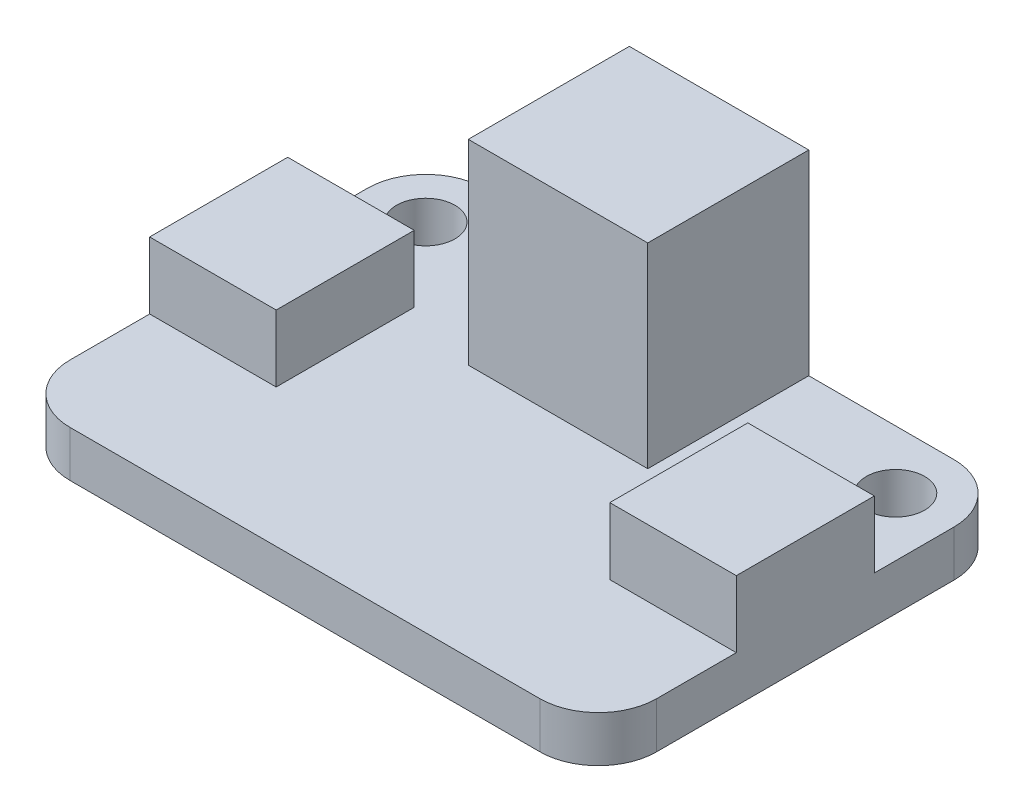
ISO-10303-21;
HEADER;
FILE_DESCRIPTION(('STEP AP214'),'2;1');
FILE_NAME('part.step','',(''),(''),'','','');
FILE_SCHEMA(('AUTOMOTIVE_DESIGN { 1 0 10303 214 1 1 1 1 }'));
ENDSEC;
DATA;
#1=APPLICATION_CONTEXT('core data for automotive mechanical design processes');
#2=APPLICATION_PROTOCOL_DEFINITION('international standard','automotive_design',2000,#1);
#3=PRODUCT_CONTEXT('',#1,'mechanical');
#4=PRODUCT('Part','Part','',(#3));
#5=PRODUCT_RELATED_PRODUCT_CATEGORY('part','',(#4));
#6=PRODUCT_DEFINITION_FORMATION('','',#4);
#7=PRODUCT_DEFINITION_CONTEXT('part definition',#1,'design');
#8=PRODUCT_DEFINITION('design','',#6,#7);
#9=PRODUCT_DEFINITION_SHAPE('','',#8);
#10=(LENGTH_UNIT() NAMED_UNIT(*) SI_UNIT(.MILLI.,.METRE.));
#11=(NAMED_UNIT(*) PLANE_ANGLE_UNIT() SI_UNIT($,.RADIAN.));
#12=(NAMED_UNIT(*) SI_UNIT($,.STERADIAN.) SOLID_ANGLE_UNIT());
#13=UNCERTAINTY_MEASURE_WITH_UNIT(LENGTH_MEASURE(1.E-05),#10,'distance_accuracy_value','');
#14=(GEOMETRIC_REPRESENTATION_CONTEXT(3) GLOBAL_UNCERTAINTY_ASSIGNED_CONTEXT((#13)) GLOBAL_UNIT_ASSIGNED_CONTEXT((#10,
#11,#12)) REPRESENTATION_CONTEXT('',''));
#15=CARTESIAN_POINT('',(0.,0.,0.));
#16=DIRECTION('',(0.,0.,1.));
#17=DIRECTION('',(1.,0.,0.));
#18=AXIS2_PLACEMENT_3D('',#15,#16,#17);
#19=CARTESIAN_POINT('',(0.,2.,0.));
#20=DIRECTION('',(0.,-1.,0.));
#21=DIRECTION('',(0.,0.,-1.));
#22=AXIS2_PLACEMENT_3D('',#19,#20,#21);
#23=PLANE('',#22);
#24=CARTESIAN_POINT('',(22.96,2.,-15.46));
#25=DIRECTION('',(0.,1.,0.));
#26=DIRECTION('',(0.,0.,-1.));
#27=AXIS2_PLACEMENT_3D('',#24,#25,#26);
#28=CIRCLE('',#27,1.27);
#29=CARTESIAN_POINT('',(22.96,2.,-16.73));
#30=VERTEX_POINT('',#29);
#31=EDGE_CURVE('E296',#30,#30,#28,.T.);
#32=ORIENTED_EDGE('',*,*,#31,.F.);
#33=EDGE_LOOP('',(#32));
#34=FACE_BOUND('',#33,.T.);
#35=CARTESIAN_POINT('',(2.54,2.,-15.46));
#36=DIRECTION('',(0.,1.,0.));
#37=DIRECTION('',(0.,0.,1.));
#38=AXIS2_PLACEMENT_3D('',#35,#36,#37);
#39=CIRCLE('',#38,1.27);
#40=CARTESIAN_POINT('',(2.54,2.,-14.19));
#41=VERTEX_POINT('',#40);
#42=EDGE_CURVE('E302',#41,#41,#39,.T.);
#43=ORIENTED_EDGE('',*,*,#42,.F.);
#44=EDGE_LOOP('',(#43));
#45=FACE_BOUND('',#44,.T.);
#46=DIRECTION('',(1.,0.,0.));
#47=VECTOR('',#46,1.);
#48=CARTESIAN_POINT('',(0.,2.,0.));
#49=LINE('',#48,#47);
#50=CARTESIAN_POINT('',(2.54,2.,0.));
#51=VERTEX_POINT('',#50);
#52=CARTESIAN_POINT('',(22.96,2.,0.));
#53=VERTEX_POINT('',#52);
#54=EDGE_CURVE('E316',#51,#53,#49,.T.);
#55=ORIENTED_EDGE('',*,*,#54,.T.);
#56=CARTESIAN_POINT('',(22.96,2.,-2.54));
#57=DIRECTION('',(0.,-1.,0.));
#58=DIRECTION('',(0.,0.,-1.));
#59=AXIS2_PLACEMENT_3D('',#56,#57,#58);
#60=CIRCLE('',#59,2.54);
#61=CARTESIAN_POINT('',(25.5,2.,-2.54));
#62=VERTEX_POINT('',#61);
#63=EDGE_CURVE('E377',#53,#62,#60,.F.);
#64=ORIENTED_EDGE('',*,*,#63,.T.);
#65=DIRECTION('',(0.,0.,-1.));
#66=VECTOR('',#65,1.);
#67=CARTESIAN_POINT('',(25.5,2.,0.));
#68=LINE('',#67,#66);
#69=CARTESIAN_POINT('',(25.5,2.,-6.));
#70=VERTEX_POINT('',#69);
#71=EDGE_CURVE('E322',#62,#70,#68,.T.);
#72=ORIENTED_EDGE('',*,*,#71,.T.);
#73=DIRECTION('',(1.,0.,0.));
#74=VECTOR('',#73,1.);
#75=CARTESIAN_POINT('',(25.5,2.,-6.));
#76=LINE('',#75,#74);
#77=CARTESIAN_POINT('',(20.,2.,-6.));
#78=VERTEX_POINT('',#77);
#79=EDGE_CURVE('E224',#78,#70,#76,.T.);
#80=ORIENTED_EDGE('',*,*,#79,.F.);
#81=DIRECTION('',(0.,0.,1.));
#82=VECTOR('',#81,1.);
#83=CARTESIAN_POINT('',(20.,2.,-12.));
#84=LINE('',#83,#82);
#85=CARTESIAN_POINT('',(20.,2.,-12.));
#86=VERTEX_POINT('',#85);
#87=EDGE_CURVE('E213',#86,#78,#84,.T.);
#88=ORIENTED_EDGE('',*,*,#87,.F.);
#89=DIRECTION('',(-1.,0.,0.));
#90=VECTOR('',#89,1.);
#91=CARTESIAN_POINT('',(25.5,2.,-12.));
#92=LINE('',#91,#90);
#93=CARTESIAN_POINT('',(25.5,2.,-12.));
#94=VERTEX_POINT('',#93);
#95=EDGE_CURVE('E208',#94,#86,#92,.T.);
#96=ORIENTED_EDGE('',*,*,#95,.F.);
#97=CARTESIAN_POINT('',(25.5,2.,-15.46));
#98=VERTEX_POINT('',#97);
#99=EDGE_CURVE('E321',#94,#98,#68,.T.);
#100=ORIENTED_EDGE('',*,*,#99,.T.);
#101=CARTESIAN_POINT('',(22.96,2.,-15.46));
#102=DIRECTION('',(0.,-1.,0.));
#103=DIRECTION('',(0.,0.,-1.));
#104=AXIS2_PLACEMENT_3D('',#101,#102,#103);
#105=CIRCLE('',#104,2.54);
#106=CARTESIAN_POINT('',(22.96,2.,-18.));
#107=VERTEX_POINT('',#106);
#108=EDGE_CURVE('E55',#98,#107,#105,.F.);
#109=ORIENTED_EDGE('',*,*,#108,.T.);
#110=DIRECTION('',(-1.,0.,0.));
#111=VECTOR('',#110,1.);
#112=CARTESIAN_POINT('',(0.,2.,-18.));
#113=LINE('',#112,#111);
#114=CARTESIAN_POINT('',(16.65,2.,-18.));
#115=VERTEX_POINT('',#114);
#116=EDGE_CURVE('E326',#107,#115,#113,.T.);
#117=ORIENTED_EDGE('',*,*,#116,.T.);
#118=DIRECTION('',(0.,0.,-1.));
#119=VECTOR('',#118,1.);
#120=CARTESIAN_POINT('',(16.65,2.,-18.));
#121=LINE('',#120,#119);
#122=CARTESIAN_POINT('',(16.65,2.,-11.));
#123=VERTEX_POINT('',#122);
#124=EDGE_CURVE('E202',#123,#115,#121,.T.);
#125=ORIENTED_EDGE('',*,*,#124,.F.);
#126=DIRECTION('',(1.,0.,0.));
#127=VECTOR('',#126,1.);
#128=CARTESIAN_POINT('',(8.84999999999999,2.,-11.));
#129=LINE('',#128,#127);
#130=CARTESIAN_POINT('',(8.84999999999999,2.,-11.));
#131=VERTEX_POINT('',#130);
#132=EDGE_CURVE('E668',#131,#123,#129,.T.);
#133=ORIENTED_EDGE('',*,*,#132,.F.);
#134=DIRECTION('',(0.,0.,1.));
#135=VECTOR('',#134,1.);
#136=CARTESIAN_POINT('',(8.85,2.,-18.));
#137=LINE('',#136,#135);
#138=CARTESIAN_POINT('',(8.85,2.,-18.));
#139=VERTEX_POINT('',#138);
#140=EDGE_CURVE('E206',#139,#131,#137,.T.);
#141=ORIENTED_EDGE('',*,*,#140,.F.);
#142=CARTESIAN_POINT('',(2.54,2.,-18.));
#143=VERTEX_POINT('',#142);
#144=EDGE_CURVE('E325',#139,#143,#113,.T.);
#145=ORIENTED_EDGE('',*,*,#144,.T.);
#146=CARTESIAN_POINT('',(2.54,2.,-15.46));
#147=DIRECTION('',(0.,-1.,0.));
#148=DIRECTION('',(0.,0.,-1.));
#149=AXIS2_PLACEMENT_3D('',#146,#147,#148);
#150=CIRCLE('',#149,2.54);
#151=CARTESIAN_POINT('',(0.,2.,-15.46));
#152=VERTEX_POINT('',#151);
#153=EDGE_CURVE('E372',#143,#152,#150,.F.);
#154=ORIENTED_EDGE('',*,*,#153,.T.);
#155=DIRECTION('',(0.,0.,1.));
#156=VECTOR('',#155,1.);
#157=CARTESIAN_POINT('',(0.,2.,0.));
#158=LINE('',#157,#156);
#159=CARTESIAN_POINT('',(0.,2.,-12.));
#160=VERTEX_POINT('',#159);
#161=EDGE_CURVE('E313',#152,#160,#158,.T.);
#162=ORIENTED_EDGE('',*,*,#161,.T.);
#163=DIRECTION('',(-1.,0.,0.));
#164=VECTOR('',#163,1.);
#165=CARTESIAN_POINT('',(0.,2.,-12.));
#166=LINE('',#165,#164);
#167=CARTESIAN_POINT('',(5.5,2.,-12.));
#168=VERTEX_POINT('',#167);
#169=EDGE_CURVE('E261',#168,#160,#166,.T.);
#170=ORIENTED_EDGE('',*,*,#169,.F.);
#171=DIRECTION('',(0.,0.,-1.));
#172=VECTOR('',#171,1.);
#173=CARTESIAN_POINT('',(5.5,2.,-12.));
#174=LINE('',#173,#172);
#175=CARTESIAN_POINT('',(5.5,2.,-6.));
#176=VERTEX_POINT('',#175);
#177=EDGE_CURVE('E274',#176,#168,#174,.T.);
#178=ORIENTED_EDGE('',*,*,#177,.F.);
#179=DIRECTION('',(1.,0.,0.));
#180=VECTOR('',#179,1.);
#181=CARTESIAN_POINT('',(0.,2.,-6.));
#182=LINE('',#181,#180);
#183=CARTESIAN_POINT('',(0.,2.,-6.));
#184=VERTEX_POINT('',#183);
#185=EDGE_CURVE('E255',#184,#176,#182,.T.);
#186=ORIENTED_EDGE('',*,*,#185,.F.);
#187=CARTESIAN_POINT('',(0.,2.,-2.54));
#188=VERTEX_POINT('',#187);
#189=EDGE_CURVE('E317',#184,#188,#158,.T.);
#190=ORIENTED_EDGE('',*,*,#189,.T.);
#191=CARTESIAN_POINT('',(2.54,2.,-2.54));
#192=DIRECTION('',(0.,-1.,0.));
#193=DIRECTION('',(0.,0.,-1.));
#194=AXIS2_PLACEMENT_3D('',#191,#192,#193);
#195=CIRCLE('',#194,2.54);
#196=EDGE_CURVE('E369',#188,#51,#195,.F.);
#197=ORIENTED_EDGE('',*,*,#196,.T.);
#198=EDGE_LOOP('',(#55,#64,#72,#80,#88,#96,#100,#109,#117,#125,#133,#141,#145,#154,#162,#170,
#178,#186,#190,#197));
#199=FACE_BOUND('',#198,.T.);
#200=ADVANCED_FACE('F39',(#34,#45,#199),#23,.F.);
#201=CARTESIAN_POINT('',(0.,2.,0.));
#202=DIRECTION('',(1.,0.,0.));
#203=DIRECTION('',(0.,0.,-1.));
#204=AXIS2_PLACEMENT_3D('',#201,#202,#203);
#205=PLANE('',#204);
#206=ORIENTED_EDGE('',*,*,#161,.F.);
#207=DIRECTION('',(0.,-1.,0.));
#208=VECTOR('',#207,1.);
#209=CARTESIAN_POINT('',(0.,2.,-15.46));
#210=LINE('',#209,#208);
#211=CARTESIAN_POINT('',(0.,0.,-15.46));
#212=VERTEX_POINT('',#211);
#213=EDGE_CURVE('E11',#152,#212,#210,.T.);
#214=ORIENTED_EDGE('',*,*,#213,.T.);
#215=DIRECTION('',(0.,0.,1.));
#216=VECTOR('',#215,1.);
#217=CARTESIAN_POINT('',(0.,0.,0.));
#218=LINE('',#217,#216);
#219=CARTESIAN_POINT('',(0.,0.,-2.54));
#220=VERTEX_POINT('',#219);
#221=EDGE_CURVE('E301',#212,#220,#218,.T.);
#222=ORIENTED_EDGE('',*,*,#221,.T.);
#223=DIRECTION('',(0.,-1.,0.));
#224=VECTOR('',#223,1.);
#225=CARTESIAN_POINT('',(0.,2.,-2.54));
#226=LINE('',#225,#224);
#227=EDGE_CURVE('E48',#220,#188,#226,.F.);
#228=ORIENTED_EDGE('',*,*,#227,.T.);
#229=ORIENTED_EDGE('',*,*,#189,.F.);
#230=DIRECTION('',(0.,-1.,0.));
#231=VECTOR('',#230,1.);
#232=CARTESIAN_POINT('',(0.,4.9,-6.));
#233=LINE('',#232,#231);
#234=CARTESIAN_POINT('',(0.,4.9,-6.));
#235=VERTEX_POINT('',#234);
#236=EDGE_CURVE('E292',#235,#184,#233,.T.);
#237=ORIENTED_EDGE('',*,*,#236,.F.);
#238=DIRECTION('',(0.,0.,1.));
#239=VECTOR('',#238,1.);
#240=CARTESIAN_POINT('',(0.,4.9,-12.));
#241=LINE('',#240,#239);
#242=CARTESIAN_POINT('',(0.,4.9,-12.));
#243=VERTEX_POINT('',#242);
#244=EDGE_CURVE('E256',#243,#235,#241,.T.);
#245=ORIENTED_EDGE('',*,*,#244,.F.);
#246=DIRECTION('',(0.,-1.,0.));
#247=VECTOR('',#246,1.);
#248=CARTESIAN_POINT('',(0.,4.9,-12.));
#249=LINE('',#248,#247);
#250=EDGE_CURVE('E270',#243,#160,#249,.T.);
#251=ORIENTED_EDGE('',*,*,#250,.T.);
#252=EDGE_LOOP('',(#206,#214,#222,#228,#229,#237,#245,#251));
#253=FACE_BOUND('',#252,.T.);
#254=ADVANCED_FACE('F439',(#253),#205,.F.);
#255=CARTESIAN_POINT('',(0.,2.,0.));
#256=DIRECTION('',(0.,0.,-1.));
#257=DIRECTION('',(-1.,0.,0.));
#258=AXIS2_PLACEMENT_3D('',#255,#256,#257);
#259=PLANE('',#258);
#260=DIRECTION('',(1.,0.,0.));
#261=VECTOR('',#260,1.);
#262=CARTESIAN_POINT('',(0.,0.,0.));
#263=LINE('',#262,#261);
#264=CARTESIAN_POINT('',(2.54,0.,0.));
#265=VERTEX_POINT('',#264);
#266=CARTESIAN_POINT('',(22.96,0.,0.));
#267=VERTEX_POINT('',#266);
#268=EDGE_CURVE('E332',#265,#267,#263,.T.);
#269=ORIENTED_EDGE('',*,*,#268,.T.);
#270=DIRECTION('',(0.,-1.,0.));
#271=VECTOR('',#270,1.);
#272=CARTESIAN_POINT('',(22.96,2.,0.));
#273=LINE('',#272,#271);
#274=EDGE_CURVE('E366',#267,#53,#273,.F.);
#275=ORIENTED_EDGE('',*,*,#274,.T.);
#276=ORIENTED_EDGE('',*,*,#54,.F.);
#277=DIRECTION('',(0.,-1.,0.));
#278=VECTOR('',#277,1.);
#279=CARTESIAN_POINT('',(2.54,2.,0.));
#280=LINE('',#279,#278);
#281=EDGE_CURVE('E362',#51,#265,#280,.T.);
#282=ORIENTED_EDGE('',*,*,#281,.T.);
#283=EDGE_LOOP('',(#269,#275,#276,#282));
#284=FACE_BOUND('',#283,.T.);
#285=ADVANCED_FACE('F398',(#284),#259,.F.);
#286=CARTESIAN_POINT('',(25.5,2.,0.));
#287=DIRECTION('',(-1.,0.,0.));
#288=DIRECTION('',(0.,0.,1.));
#289=AXIS2_PLACEMENT_3D('',#286,#287,#288);
#290=PLANE('',#289);
#291=ORIENTED_EDGE('',*,*,#71,.F.);
#292=DIRECTION('',(0.,-1.,0.));
#293=VECTOR('',#292,1.);
#294=CARTESIAN_POINT('',(25.5,2.,-2.54));
#295=LINE('',#294,#293);
#296=CARTESIAN_POINT('',(25.5,0.,-2.54));
#297=VERTEX_POINT('',#296);
#298=EDGE_CURVE('E346',#62,#297,#295,.T.);
#299=ORIENTED_EDGE('',*,*,#298,.T.);
#300=DIRECTION('',(0.,0.,-1.));
#301=VECTOR('',#300,1.);
#302=CARTESIAN_POINT('',(25.5,0.,0.));
#303=LINE('',#302,#301);
#304=CARTESIAN_POINT('',(25.5,0.,-15.46));
#305=VERTEX_POINT('',#304);
#306=EDGE_CURVE('E336',#297,#305,#303,.T.);
#307=ORIENTED_EDGE('',*,*,#306,.T.);
#308=DIRECTION('',(0.,-1.,0.));
#309=VECTOR('',#308,1.);
#310=CARTESIAN_POINT('',(25.5,2.,-15.46));
#311=LINE('',#310,#309);
#312=EDGE_CURVE('E329',#305,#98,#311,.F.);
#313=ORIENTED_EDGE('',*,*,#312,.T.);
#314=ORIENTED_EDGE('',*,*,#99,.F.);
#315=DIRECTION('',(0.,-1.,0.));
#316=VECTOR('',#315,1.);
#317=CARTESIAN_POINT('',(25.5,4.9,-12.));
#318=LINE('',#317,#316);
#319=CARTESIAN_POINT('',(25.5,4.9,-12.));
#320=VERTEX_POINT('',#319);
#321=EDGE_CURVE('E251',#320,#94,#318,.T.);
#322=ORIENTED_EDGE('',*,*,#321,.F.);
#323=DIRECTION('',(0.,0.,-1.));
#324=VECTOR('',#323,1.);
#325=CARTESIAN_POINT('',(25.5,4.9,-12.));
#326=LINE('',#325,#324);
#327=CARTESIAN_POINT('',(25.5,4.9,-6.));
#328=VERTEX_POINT('',#327);
#329=EDGE_CURVE('E219',#328,#320,#326,.T.);
#330=ORIENTED_EDGE('',*,*,#329,.F.);
#331=DIRECTION('',(0.,-1.,0.));
#332=VECTOR('',#331,1.);
#333=CARTESIAN_POINT('',(25.5,4.9,-6.));
#334=LINE('',#333,#332);
#335=EDGE_CURVE('E232',#328,#70,#334,.T.);
#336=ORIENTED_EDGE('',*,*,#335,.T.);
#337=EDGE_LOOP('',(#291,#299,#307,#313,#314,#322,#330,#336));
#338=FACE_BOUND('',#337,.T.);
#339=ADVANCED_FACE('F410',(#338),#290,.F.);
#340=CARTESIAN_POINT('',(0.,2.,-18.));
#341=DIRECTION('',(0.,0.,1.));
#342=DIRECTION('',(1.,0.,0.));
#343=AXIS2_PLACEMENT_3D('',#340,#341,#342);
#344=PLANE('',#343);
#345=ORIENTED_EDGE('',*,*,#116,.F.);
#346=DIRECTION('',(0.,-1.,0.));
#347=VECTOR('',#346,1.);
#348=CARTESIAN_POINT('',(22.96,2.,-18.));
#349=LINE('',#348,#347);
#350=CARTESIAN_POINT('',(22.96,0.,-18.));
#351=VERTEX_POINT('',#350);
#352=EDGE_CURVE('E383',#107,#351,#349,.T.);
#353=ORIENTED_EDGE('',*,*,#352,.T.);
#354=DIRECTION('',(-1.,0.,0.));
#355=VECTOR('',#354,1.);
#356=CARTESIAN_POINT('',(0.,0.,-18.));
#357=LINE('',#356,#355);
#358=CARTESIAN_POINT('',(2.54,0.,-18.));
#359=VERTEX_POINT('',#358);
#360=EDGE_CURVE('E340',#351,#359,#357,.T.);
#361=ORIENTED_EDGE('',*,*,#360,.T.);
#362=DIRECTION('',(0.,-1.,0.));
#363=VECTOR('',#362,1.);
#364=CARTESIAN_POINT('',(2.54,2.,-18.));
#365=LINE('',#364,#363);
#366=EDGE_CURVE('E380',#359,#143,#365,.F.);
#367=ORIENTED_EDGE('',*,*,#366,.T.);
#368=ORIENTED_EDGE('',*,*,#144,.F.);
#369=DIRECTION('',(0.,-1.,0.));
#370=VECTOR('',#369,1.);
#371=CARTESIAN_POINT('',(8.85,10.5,-18.));
#372=LINE('',#371,#370);
#373=CARTESIAN_POINT('',(8.85,10.5,-18.));
#374=VERTEX_POINT('',#373);
#375=EDGE_CURVE('E671',#374,#139,#372,.T.);
#376=ORIENTED_EDGE('',*,*,#375,.F.);
#377=DIRECTION('',(-1.,0.,0.));
#378=VECTOR('',#377,1.);
#379=CARTESIAN_POINT('',(8.85,10.5,-18.));
#380=LINE('',#379,#378);
#381=CARTESIAN_POINT('',(16.65,10.5,-18.));
#382=VERTEX_POINT('',#381);
#383=EDGE_CURVE('E197',#382,#374,#380,.T.);
#384=ORIENTED_EDGE('',*,*,#383,.F.);
#385=DIRECTION('',(0.,-1.,0.));
#386=VECTOR('',#385,1.);
#387=CARTESIAN_POINT('',(16.65,10.5,-18.));
#388=LINE('',#387,#386);
#389=EDGE_CURVE('E215',#382,#115,#388,.T.);
#390=ORIENTED_EDGE('',*,*,#389,.T.);
#391=EDGE_LOOP('',(#345,#353,#361,#367,#368,#376,#384,#390));
#392=FACE_BOUND('',#391,.T.);
#393=ADVANCED_FACE('F431',(#392),#344,.F.);
#394=CARTESIAN_POINT('',(0.,0.,0.));
#395=DIRECTION('',(0.,-1.,0.));
#396=DIRECTION('',(0.,0.,-1.));
#397=AXIS2_PLACEMENT_3D('',#394,#395,#396);
#398=PLANE('',#397);
#399=CARTESIAN_POINT('',(2.54,0.,-15.46));
#400=DIRECTION('',(0.,1.,0.));
#401=DIRECTION('',(0.,0.,1.));
#402=AXIS2_PLACEMENT_3D('',#399,#400,#401);
#403=CIRCLE('',#402,1.27);
#404=CARTESIAN_POINT('',(2.54,0.,-14.19));
#405=VERTEX_POINT('',#404);
#406=EDGE_CURVE('E297',#405,#405,#403,.T.);
#407=ORIENTED_EDGE('',*,*,#406,.T.);
#408=EDGE_LOOP('',(#407));
#409=FACE_BOUND('',#408,.T.);
#410=CARTESIAN_POINT('',(22.96,0.,-15.46));
#411=DIRECTION('',(0.,1.,0.));
#412=DIRECTION('',(0.,0.,-1.));
#413=AXIS2_PLACEMENT_3D('',#410,#411,#412);
#414=CIRCLE('',#413,1.27);
#415=CARTESIAN_POINT('',(22.96,0.,-16.73));
#416=VERTEX_POINT('',#415);
#417=EDGE_CURVE('E306',#416,#416,#414,.T.);
#418=ORIENTED_EDGE('',*,*,#417,.T.);
#419=EDGE_LOOP('',(#418));
#420=FACE_BOUND('',#419,.T.);
#421=ORIENTED_EDGE('',*,*,#306,.F.);
#422=CARTESIAN_POINT('',(22.96,0.,-2.54));
#423=DIRECTION('',(0.,-1.,0.));
#424=DIRECTION('',(0.,0.,-1.));
#425=AXIS2_PLACEMENT_3D('',#422,#423,#424);
#426=CIRCLE('',#425,2.54);
#427=EDGE_CURVE('E359',#297,#267,#426,.T.);
#428=ORIENTED_EDGE('',*,*,#427,.T.);
#429=ORIENTED_EDGE('',*,*,#268,.F.);
#430=CARTESIAN_POINT('',(2.54,0.,-2.54));
#431=DIRECTION('',(0.,-1.,0.));
#432=DIRECTION('',(0.,0.,-1.));
#433=AXIS2_PLACEMENT_3D('',#430,#431,#432);
#434=CIRCLE('',#433,2.54);
#435=EDGE_CURVE('E350',#265,#220,#434,.T.);
#436=ORIENTED_EDGE('',*,*,#435,.T.);
#437=ORIENTED_EDGE('',*,*,#221,.F.);
#438=CARTESIAN_POINT('',(2.54,0.,-15.46));
#439=DIRECTION('',(0.,-1.,0.));
#440=DIRECTION('',(0.,0.,-1.));
#441=AXIS2_PLACEMENT_3D('',#438,#439,#440);
#442=CIRCLE('',#441,2.54);
#443=EDGE_CURVE('E353',#212,#359,#442,.T.);
#444=ORIENTED_EDGE('',*,*,#443,.T.);
#445=ORIENTED_EDGE('',*,*,#360,.F.);
#446=CARTESIAN_POINT('',(22.96,0.,-15.46));
#447=DIRECTION('',(0.,-1.,0.));
#448=DIRECTION('',(0.,0.,-1.));
#449=AXIS2_PLACEMENT_3D('',#446,#447,#448);
#450=CIRCLE('',#449,2.54);
#451=EDGE_CURVE('E356',#351,#305,#450,.T.);
#452=ORIENTED_EDGE('',*,*,#451,.T.);
#453=EDGE_LOOP('',(#421,#428,#429,#436,#437,#444,#445,#452));
#454=FACE_BOUND('',#453,.T.);
#455=ADVANCED_FACE('F402',(#409,#420,#454),#398,.T.);
#456=CARTESIAN_POINT('',(22.96,0.,-15.46));
#457=DIRECTION('',(0.,1.,0.));
#458=DIRECTION('',(0.,0.,1.));
#459=AXIS2_PLACEMENT_3D('',#456,#457,#458);
#460=CYLINDRICAL_SURFACE('',#459,1.27);
#461=ORIENTED_EDGE('',*,*,#417,.F.);
#462=EDGE_LOOP('',(#461));
#463=FACE_BOUND('',#462,.T.);
#464=ORIENTED_EDGE('',*,*,#31,.T.);
#465=EDGE_LOOP('',(#464));
#466=FACE_BOUND('',#465,.T.);
#467=ADVANCED_FACE('F473',(#463,#466),#460,.F.);
#468=CARTESIAN_POINT('',(2.54,0.,-15.46));
#469=DIRECTION('',(0.,1.,0.));
#470=DIRECTION('',(0.,0.,1.));
#471=AXIS2_PLACEMENT_3D('',#468,#469,#470);
#472=CYLINDRICAL_SURFACE('',#471,1.27);
#473=ORIENTED_EDGE('',*,*,#406,.F.);
#474=EDGE_LOOP('',(#473));
#475=FACE_BOUND('',#474,.T.);
#476=ORIENTED_EDGE('',*,*,#42,.T.);
#477=EDGE_LOOP('',(#476));
#478=FACE_BOUND('',#477,.T.);
#479=ADVANCED_FACE('F642',(#475,#478),#472,.F.);
#480=CARTESIAN_POINT('',(0.,4.9,-6.));
#481=DIRECTION('',(0.,0.,-1.));
#482=DIRECTION('',(-1.,0.,0.));
#483=AXIS2_PLACEMENT_3D('',#480,#481,#482);
#484=PLANE('',#483);
#485=ORIENTED_EDGE('',*,*,#185,.T.);
#486=DIRECTION('',(0.,-1.,0.));
#487=VECTOR('',#486,1.);
#488=CARTESIAN_POINT('',(5.5,4.9,-6.));
#489=LINE('',#488,#487);
#490=CARTESIAN_POINT('',(5.5,4.9,-6.));
#491=VERTEX_POINT('',#490);
#492=EDGE_CURVE('E288',#491,#176,#489,.T.);
#493=ORIENTED_EDGE('',*,*,#492,.F.);
#494=DIRECTION('',(1.,0.,0.));
#495=VECTOR('',#494,1.);
#496=CARTESIAN_POINT('',(0.,4.9,-6.));
#497=LINE('',#496,#495);
#498=EDGE_CURVE('E260',#235,#491,#497,.T.);
#499=ORIENTED_EDGE('',*,*,#498,.F.);
#500=ORIENTED_EDGE('',*,*,#236,.T.);
#501=EDGE_LOOP('',(#485,#493,#499,#500));
#502=FACE_BOUND('',#501,.T.);
#503=ADVANCED_FACE('F451',(#502),#484,.F.);
#504=CARTESIAN_POINT('',(5.5,4.9,-12.));
#505=DIRECTION('',(-1.,0.,0.));
#506=DIRECTION('',(0.,0.,1.));
#507=AXIS2_PLACEMENT_3D('',#504,#505,#506);
#508=PLANE('',#507);
#509=ORIENTED_EDGE('',*,*,#177,.T.);
#510=DIRECTION('',(0.,-1.,0.));
#511=VECTOR('',#510,1.);
#512=CARTESIAN_POINT('',(5.5,4.9,-12.));
#513=LINE('',#512,#511);
#514=CARTESIAN_POINT('',(5.5,4.9,-12.));
#515=VERTEX_POINT('',#514);
#516=EDGE_CURVE('E284',#515,#168,#513,.T.);
#517=ORIENTED_EDGE('',*,*,#516,.F.);
#518=DIRECTION('',(0.,0.,-1.));
#519=VECTOR('',#518,1.);
#520=CARTESIAN_POINT('',(5.5,4.9,-12.));
#521=LINE('',#520,#519);
#522=EDGE_CURVE('E264',#491,#515,#521,.T.);
#523=ORIENTED_EDGE('',*,*,#522,.F.);
#524=ORIENTED_EDGE('',*,*,#492,.T.);
#525=EDGE_LOOP('',(#509,#517,#523,#524));
#526=FACE_BOUND('',#525,.T.);
#527=ADVANCED_FACE('F448',(#526),#508,.F.);
#528=CARTESIAN_POINT('',(0.,4.9,-12.));
#529=DIRECTION('',(0.,0.,1.));
#530=DIRECTION('',(1.,0.,0.));
#531=AXIS2_PLACEMENT_3D('',#528,#529,#530);
#532=PLANE('',#531);
#533=ORIENTED_EDGE('',*,*,#169,.T.);
#534=ORIENTED_EDGE('',*,*,#250,.F.);
#535=DIRECTION('',(-1.,0.,0.));
#536=VECTOR('',#535,1.);
#537=CARTESIAN_POINT('',(0.,4.9,-12.));
#538=LINE('',#537,#536);
#539=EDGE_CURVE('E267',#515,#243,#538,.T.);
#540=ORIENTED_EDGE('',*,*,#539,.F.);
#541=ORIENTED_EDGE('',*,*,#516,.T.);
#542=EDGE_LOOP('',(#533,#534,#540,#541));
#543=FACE_BOUND('',#542,.T.);
#544=ADVANCED_FACE('F443',(#543),#532,.F.);
#545=CARTESIAN_POINT('',(0.,4.9,0.));
#546=DIRECTION('',(0.,1.,0.));
#547=DIRECTION('',(0.,0.,1.));
#548=AXIS2_PLACEMENT_3D('',#545,#546,#547);
#549=PLANE('',#548);
#550=ORIENTED_EDGE('',*,*,#244,.T.);
#551=ORIENTED_EDGE('',*,*,#498,.T.);
#552=ORIENTED_EDGE('',*,*,#522,.T.);
#553=ORIENTED_EDGE('',*,*,#539,.T.);
#554=EDGE_LOOP('',(#550,#551,#552,#553));
#555=FACE_BOUND('',#554,.T.);
#556=ADVANCED_FACE('F453',(#555),#549,.T.);
#557=CARTESIAN_POINT('',(25.5,4.9,-12.));
#558=DIRECTION('',(0.,0.,1.));
#559=DIRECTION('',(1.,0.,0.));
#560=AXIS2_PLACEMENT_3D('',#557,#558,#559);
#561=PLANE('',#560);
#562=ORIENTED_EDGE('',*,*,#95,.T.);
#563=DIRECTION('',(0.,-1.,0.));
#564=VECTOR('',#563,1.);
#565=CARTESIAN_POINT('',(20.,4.9,-12.));
#566=LINE('',#565,#564);
#567=CARTESIAN_POINT('',(20.,4.9,-12.));
#568=VERTEX_POINT('',#567);
#569=EDGE_CURVE('E247',#568,#86,#566,.T.);
#570=ORIENTED_EDGE('',*,*,#569,.F.);
#571=DIRECTION('',(-1.,0.,0.));
#572=VECTOR('',#571,1.);
#573=CARTESIAN_POINT('',(25.5,4.9,-12.));
#574=LINE('',#573,#572);
#575=EDGE_CURVE('E223',#320,#568,#574,.T.);
#576=ORIENTED_EDGE('',*,*,#575,.F.);
#577=ORIENTED_EDGE('',*,*,#321,.T.);
#578=EDGE_LOOP('',(#562,#570,#576,#577));
#579=FACE_BOUND('',#578,.T.);
#580=ADVANCED_FACE('F424',(#579),#561,.F.);
#581=CARTESIAN_POINT('',(20.,4.9,-12.));
#582=DIRECTION('',(1.,0.,0.));
#583=DIRECTION('',(0.,0.,-1.));
#584=AXIS2_PLACEMENT_3D('',#581,#582,#583);
#585=PLANE('',#584);
#586=ORIENTED_EDGE('',*,*,#87,.T.);
#587=DIRECTION('',(0.,-1.,0.));
#588=VECTOR('',#587,1.);
#589=CARTESIAN_POINT('',(20.,4.9,-6.));
#590=LINE('',#589,#588);
#591=CARTESIAN_POINT('',(20.,4.9,-6.));
#592=VERTEX_POINT('',#591);
#593=EDGE_CURVE('E243',#592,#78,#590,.T.);
#594=ORIENTED_EDGE('',*,*,#593,.F.);
#595=DIRECTION('',(0.,0.,1.));
#596=VECTOR('',#595,1.);
#597=CARTESIAN_POINT('',(20.,4.9,-12.));
#598=LINE('',#597,#596);
#599=EDGE_CURVE('E227',#568,#592,#598,.T.);
#600=ORIENTED_EDGE('',*,*,#599,.F.);
#601=ORIENTED_EDGE('',*,*,#569,.T.);
#602=EDGE_LOOP('',(#586,#594,#600,#601));
#603=FACE_BOUND('',#602,.T.);
#604=ADVANCED_FACE('F420',(#603),#585,.F.);
#605=CARTESIAN_POINT('',(25.5,4.9,-6.));
#606=DIRECTION('',(0.,0.,-1.));
#607=DIRECTION('',(-1.,0.,0.));
#608=AXIS2_PLACEMENT_3D('',#605,#606,#607);
#609=PLANE('',#608);
#610=ORIENTED_EDGE('',*,*,#79,.T.);
#611=ORIENTED_EDGE('',*,*,#335,.F.);
#612=DIRECTION('',(1.,0.,0.));
#613=VECTOR('',#612,1.);
#614=CARTESIAN_POINT('',(25.5,4.9,-6.));
#615=LINE('',#614,#613);
#616=EDGE_CURVE('E230',#592,#328,#615,.T.);
#617=ORIENTED_EDGE('',*,*,#616,.F.);
#618=ORIENTED_EDGE('',*,*,#593,.T.);
#619=EDGE_LOOP('',(#610,#611,#617,#618));
#620=FACE_BOUND('',#619,.T.);
#621=ADVANCED_FACE('F415',(#620),#609,.F.);
#622=CARTESIAN_POINT('',(0.,4.9,0.));
#623=DIRECTION('',(0.,-1.,0.));
#624=DIRECTION('',(0.,0.,-1.));
#625=AXIS2_PLACEMENT_3D('',#622,#623,#624);
#626=PLANE('',#625);
#627=ORIENTED_EDGE('',*,*,#329,.T.);
#628=ORIENTED_EDGE('',*,*,#575,.T.);
#629=ORIENTED_EDGE('',*,*,#599,.T.);
#630=ORIENTED_EDGE('',*,*,#616,.T.);
#631=EDGE_LOOP('',(#627,#628,#629,#630));
#632=FACE_BOUND('',#631,.T.);
#633=ADVANCED_FACE('F586',(#632),#626,.F.);
#634=CARTESIAN_POINT('',(8.85,10.5,-18.));
#635=DIRECTION('',(1.,0.,0.));
#636=DIRECTION('',(0.,0.,-1.));
#637=AXIS2_PLACEMENT_3D('',#634,#635,#636);
#638=PLANE('',#637);
#639=ORIENTED_EDGE('',*,*,#140,.T.);
#640=DIRECTION('',(0.,-1.,0.));
#641=VECTOR('',#640,1.);
#642=CARTESIAN_POINT('',(8.84999999999999,10.5,-11.));
#643=LINE('',#642,#641);
#644=CARTESIAN_POINT('',(8.84999999999999,10.5,-11.));
#645=VERTEX_POINT('',#644);
#646=EDGE_CURVE('E184',#645,#131,#643,.T.);
#647=ORIENTED_EDGE('',*,*,#646,.F.);
#648=DIRECTION('',(0.,0.,1.));
#649=VECTOR('',#648,1.);
#650=CARTESIAN_POINT('',(8.85,10.5,-18.));
#651=LINE('',#650,#649);
#652=EDGE_CURVE('E192',#374,#645,#651,.T.);
#653=ORIENTED_EDGE('',*,*,#652,.F.);
#654=ORIENTED_EDGE('',*,*,#375,.T.);
#655=EDGE_LOOP('',(#639,#647,#653,#654));
#656=FACE_BOUND('',#655,.T.);
#657=ADVANCED_FACE('F204',(#656),#638,.F.);
#658=CARTESIAN_POINT('',(8.84999999999999,10.5,-11.));
#659=DIRECTION('',(0.,0.,-1.));
#660=DIRECTION('',(-1.,0.,0.));
#661=AXIS2_PLACEMENT_3D('',#658,#659,#660);
#662=PLANE('',#661);
#663=ORIENTED_EDGE('',*,*,#132,.T.);
#664=DIRECTION('',(0.,-1.,0.));
#665=VECTOR('',#664,1.);
#666=CARTESIAN_POINT('',(16.65,10.5,-11.));
#667=LINE('',#666,#665);
#668=CARTESIAN_POINT('',(16.65,10.5,-11.));
#669=VERTEX_POINT('',#668);
#670=EDGE_CURVE('E187',#669,#123,#667,.T.);
#671=ORIENTED_EDGE('',*,*,#670,.F.);
#672=DIRECTION('',(1.,0.,0.));
#673=VECTOR('',#672,1.);
#674=CARTESIAN_POINT('',(8.84999999999999,10.5,-11.));
#675=LINE('',#674,#673);
#676=EDGE_CURVE('E179',#645,#669,#675,.T.);
#677=ORIENTED_EDGE('',*,*,#676,.F.);
#678=ORIENTED_EDGE('',*,*,#646,.T.);
#679=EDGE_LOOP('',(#663,#671,#677,#678));
#680=FACE_BOUND('',#679,.T.);
#681=ADVANCED_FACE('F182',(#680),#662,.F.);
#682=CARTESIAN_POINT('',(16.65,10.5,-18.));
#683=DIRECTION('',(-1.,0.,0.));
#684=DIRECTION('',(0.,0.,1.));
#685=AXIS2_PLACEMENT_3D('',#682,#683,#684);
#686=PLANE('',#685);
#687=ORIENTED_EDGE('',*,*,#124,.T.);
#688=ORIENTED_EDGE('',*,*,#389,.F.);
#689=DIRECTION('',(0.,0.,-1.));
#690=VECTOR('',#689,1.);
#691=CARTESIAN_POINT('',(16.65,10.5,-18.));
#692=LINE('',#691,#690);
#693=EDGE_CURVE('E191',#669,#382,#692,.T.);
#694=ORIENTED_EDGE('',*,*,#693,.F.);
#695=ORIENTED_EDGE('',*,*,#670,.T.);
#696=EDGE_LOOP('',(#687,#688,#694,#695));
#697=FACE_BOUND('',#696,.T.);
#698=ADVANCED_FACE('F561',(#697),#686,.F.);
#699=CARTESIAN_POINT('',(0.,10.5,0.));
#700=DIRECTION('',(0.,1.,0.));
#701=DIRECTION('',(0.,0.,1.));
#702=AXIS2_PLACEMENT_3D('',#699,#700,#701);
#703=PLANE('',#702);
#704=ORIENTED_EDGE('',*,*,#652,.T.);
#705=ORIENTED_EDGE('',*,*,#676,.T.);
#706=ORIENTED_EDGE('',*,*,#693,.T.);
#707=ORIENTED_EDGE('',*,*,#383,.T.);
#708=EDGE_LOOP('',(#704,#705,#706,#707));
#709=FACE_BOUND('',#708,.T.);
#710=ADVANCED_FACE('F195',(#709),#703,.T.);
#711=CARTESIAN_POINT('',(22.96,2.,-2.54));
#712=DIRECTION('',(0.,-1.,0.));
#713=DIRECTION('',(0.,0.,-1.));
#714=AXIS2_PLACEMENT_3D('',#711,#712,#713);
#715=CYLINDRICAL_SURFACE('',#714,2.54);
#716=ORIENTED_EDGE('',*,*,#63,.F.);
#717=ORIENTED_EDGE('',*,*,#274,.F.);
#718=ORIENTED_EDGE('',*,*,#427,.F.);
#719=ORIENTED_EDGE('',*,*,#298,.F.);
#720=EDGE_LOOP('',(#716,#717,#718,#719));
#721=FACE_BOUND('',#720,.T.);
#722=ADVANCED_FACE('F407',(#721),#715,.T.);
#723=CARTESIAN_POINT('',(22.96,2.,-15.46));
#724=DIRECTION('',(0.,-1.,0.));
#725=DIRECTION('',(0.,0.,-1.));
#726=AXIS2_PLACEMENT_3D('',#723,#724,#725);
#727=CYLINDRICAL_SURFACE('',#726,2.54);
#728=ORIENTED_EDGE('',*,*,#108,.F.);
#729=ORIENTED_EDGE('',*,*,#312,.F.);
#730=ORIENTED_EDGE('',*,*,#451,.F.);
#731=ORIENTED_EDGE('',*,*,#352,.F.);
#732=EDGE_LOOP('',(#728,#729,#730,#731));
#733=FACE_BOUND('',#732,.T.);
#734=ADVANCED_FACE('F428',(#733),#727,.T.);
#735=CARTESIAN_POINT('',(2.54,2.,-15.46));
#736=DIRECTION('',(0.,-1.,0.));
#737=DIRECTION('',(0.,0.,-1.));
#738=AXIS2_PLACEMENT_3D('',#735,#736,#737);
#739=CYLINDRICAL_SURFACE('',#738,2.54);
#740=ORIENTED_EDGE('',*,*,#153,.F.);
#741=ORIENTED_EDGE('',*,*,#366,.F.);
#742=ORIENTED_EDGE('',*,*,#443,.F.);
#743=ORIENTED_EDGE('',*,*,#213,.F.);
#744=EDGE_LOOP('',(#740,#741,#742,#743));
#745=FACE_BOUND('',#744,.T.);
#746=ADVANCED_FACE('F437',(#745),#739,.T.);
#747=CARTESIAN_POINT('',(2.54,2.,-2.54));
#748=DIRECTION('',(0.,-1.,0.));
#749=DIRECTION('',(0.,0.,-1.));
#750=AXIS2_PLACEMENT_3D('',#747,#748,#749);
#751=CYLINDRICAL_SURFACE('',#750,2.54);
#752=ORIENTED_EDGE('',*,*,#196,.F.);
#753=ORIENTED_EDGE('',*,*,#227,.F.);
#754=ORIENTED_EDGE('',*,*,#435,.F.);
#755=ORIENTED_EDGE('',*,*,#281,.F.);
#756=EDGE_LOOP('',(#752,#753,#754,#755));
#757=FACE_BOUND('',#756,.T.);
#758=ADVANCED_FACE('F41',(#757),#751,.T.);
#759=CLOSED_SHELL('',(#200,#254,#285,#339,#393,#455,#467,#479,#503,#527,#544,#556,#580,#604,
#621,#633,#657,#681,#698,#710,#722,#734,#746,#758));
#760=MANIFOLD_SOLID_BREP('B2',#759);
#761=ADVANCED_BREP_SHAPE_REPRESENTATION('',(#18,#760),#14);
#762=SHAPE_DEFINITION_REPRESENTATION(#9,#761);
ENDSEC;
END-ISO-10303-21;
